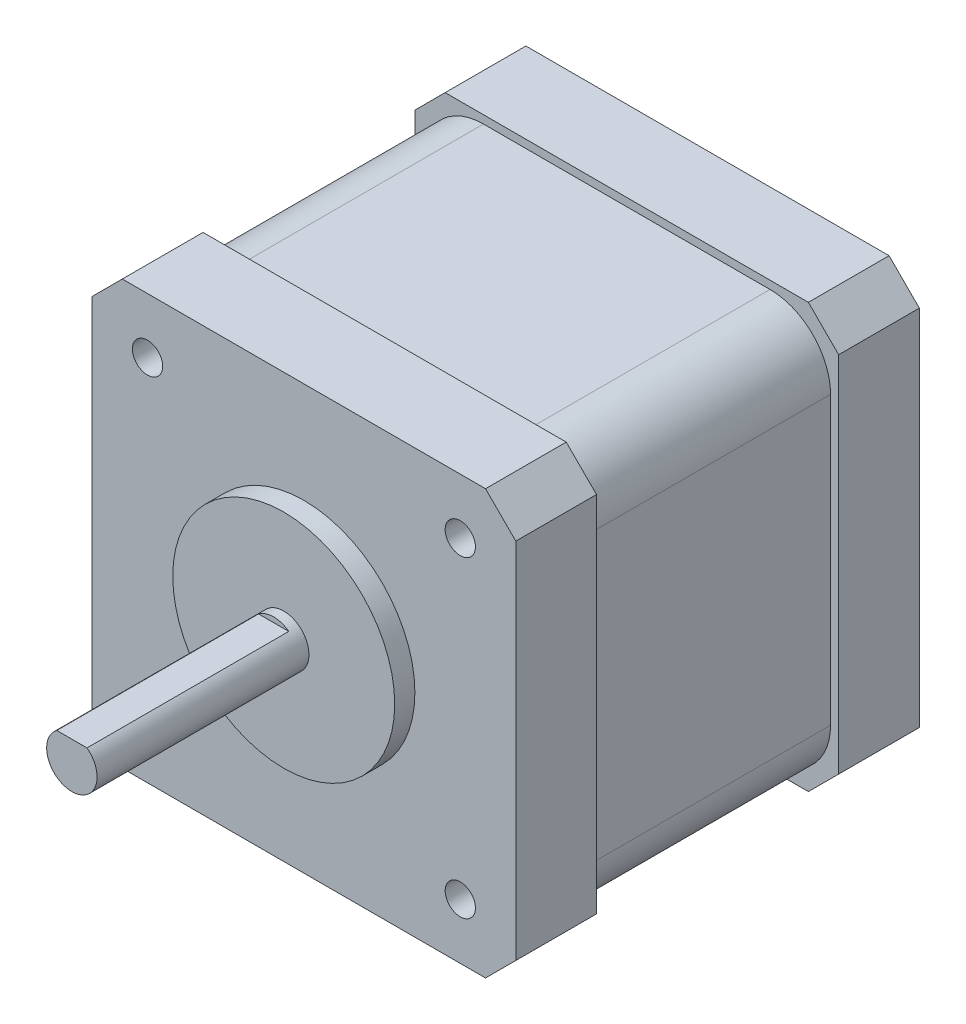
ISO-10303-21;
HEADER;
FILE_DESCRIPTION(('STEP AP214'),'2;1');
FILE_NAME('part.step','',(''),(''),'','','');
FILE_SCHEMA(('AUTOMOTIVE_DESIGN { 1 0 10303 214 1 1 1 1 }'));
ENDSEC;
DATA;
#1=APPLICATION_CONTEXT('core data for automotive mechanical design processes');
#2=APPLICATION_PROTOCOL_DEFINITION('international standard','automotive_design',2000,#1);
#3=PRODUCT_CONTEXT('',#1,'mechanical');
#4=PRODUCT('Part','Part','',(#3));
#5=PRODUCT_RELATED_PRODUCT_CATEGORY('part','',(#4));
#6=PRODUCT_DEFINITION_FORMATION('','',#4);
#7=PRODUCT_DEFINITION_CONTEXT('part definition',#1,'design');
#8=PRODUCT_DEFINITION('design','',#6,#7);
#9=PRODUCT_DEFINITION_SHAPE('','',#8);
#10=(LENGTH_UNIT() NAMED_UNIT(*) SI_UNIT(.MILLI.,.METRE.));
#11=(NAMED_UNIT(*) PLANE_ANGLE_UNIT() SI_UNIT($,.RADIAN.));
#12=(NAMED_UNIT(*) SI_UNIT($,.STERADIAN.) SOLID_ANGLE_UNIT());
#13=UNCERTAINTY_MEASURE_WITH_UNIT(LENGTH_MEASURE(1.E-05),#10,'distance_accuracy_value','');
#14=(GEOMETRIC_REPRESENTATION_CONTEXT(3) GLOBAL_UNCERTAINTY_ASSIGNED_CONTEXT((#13)) GLOBAL_UNIT_ASSIGNED_CONTEXT((#10,
#11,#12)) REPRESENTATION_CONTEXT('',''));
#15=CARTESIAN_POINT('',(0.,0.,0.));
#16=DIRECTION('',(0.,0.,1.));
#17=DIRECTION('',(1.,0.,0.));
#18=AXIS2_PLACEMENT_3D('',#15,#16,#17);
#19=CARTESIAN_POINT('',(-21.,-21.,0.));
#20=DIRECTION('',(0.,0.,1.));
#21=DIRECTION('',(1.,0.,0.));
#22=AXIS2_PLACEMENT_3D('',#19,#20,#21);
#23=PLANE('',#22);
#24=DIRECTION('',(-0.707106781186548,0.707106781186548,0.));
#25=VECTOR('',#24,1.);
#26=CARTESIAN_POINT('',(-19.5,-19.5,0.));
#27=LINE('',#26,#25);
#28=CARTESIAN_POINT('',(-18.0000000045,-21.,0.));
#29=VERTEX_POINT('',#28);
#30=CARTESIAN_POINT('',(-21.,-18.0000000045,0.));
#31=VERTEX_POINT('',#30);
#32=EDGE_CURVE('E155',#29,#31,#27,.T.);
#33=ORIENTED_EDGE('',*,*,#32,.T.);
#34=DIRECTION('',(0.,1.,0.));
#35=VECTOR('',#34,1.);
#36=CARTESIAN_POINT('',(-21.,0.,0.));
#37=LINE('',#36,#35);
#38=CARTESIAN_POINT('',(-21.,18.0000000045,0.));
#39=VERTEX_POINT('',#38);
#40=EDGE_CURVE('E179',#31,#39,#37,.T.);
#41=ORIENTED_EDGE('',*,*,#40,.T.);
#42=DIRECTION('',(0.707106781186548,0.707106781186548,0.));
#43=VECTOR('',#42,1.);
#44=CARTESIAN_POINT('',(-19.5,19.5,0.));
#45=LINE('',#44,#43);
#46=CARTESIAN_POINT('',(-18.0000000045,21.,0.));
#47=VERTEX_POINT('',#46);
#48=EDGE_CURVE('E178',#39,#47,#45,.T.);
#49=ORIENTED_EDGE('',*,*,#48,.T.);
#50=DIRECTION('',(1.,0.,0.));
#51=VECTOR('',#50,1.);
#52=CARTESIAN_POINT('',(0.,21.,0.));
#53=LINE('',#52,#51);
#54=CARTESIAN_POINT('',(18.0000000045,21.,0.));
#55=VERTEX_POINT('',#54);
#56=EDGE_CURVE('E176',#47,#55,#53,.T.);
#57=ORIENTED_EDGE('',*,*,#56,.T.);
#58=DIRECTION('',(0.707106781186548,-0.707106781186548,0.));
#59=VECTOR('',#58,1.);
#60=CARTESIAN_POINT('',(19.5,19.5,0.));
#61=LINE('',#60,#59);
#62=CARTESIAN_POINT('',(21.,18.0000000045,0.));
#63=VERTEX_POINT('',#62);
#64=EDGE_CURVE('E337',#55,#63,#61,.T.);
#65=ORIENTED_EDGE('',*,*,#64,.T.);
#66=DIRECTION('',(0.,-1.,0.));
#67=VECTOR('',#66,1.);
#68=CARTESIAN_POINT('',(21.,0.,0.));
#69=LINE('',#68,#67);
#70=CARTESIAN_POINT('',(21.,-18.0000000045,0.));
#71=VERTEX_POINT('',#70);
#72=EDGE_CURVE('E336',#63,#71,#69,.T.);
#73=ORIENTED_EDGE('',*,*,#72,.T.);
#74=DIRECTION('',(-0.707106781186548,-0.707106781186548,0.));
#75=VECTOR('',#74,1.);
#76=CARTESIAN_POINT('',(19.5,-19.5,0.));
#77=LINE('',#76,#75);
#78=CARTESIAN_POINT('',(18.0000000045,-21.,0.));
#79=VERTEX_POINT('',#78);
#80=EDGE_CURVE('E357',#71,#79,#77,.T.);
#81=ORIENTED_EDGE('',*,*,#80,.T.);
#82=DIRECTION('',(-1.,0.,0.));
#83=VECTOR('',#82,1.);
#84=CARTESIAN_POINT('',(0.,-21.,0.));
#85=LINE('',#84,#83);
#86=EDGE_CURVE('E347',#79,#29,#85,.T.);
#87=ORIENTED_EDGE('',*,*,#86,.T.);
#88=EDGE_LOOP('',(#33,#41,#49,#57,#65,#73,#81,#87));
#89=FACE_BOUND('',#88,.T.);
#90=ADVANCED_FACE('F16',(#89),#23,.F.);
#91=CARTESIAN_POINT('',(-21.,18.,8.));
#92=DIRECTION('',(0.707106781186547,-0.707106781186547,0.));
#93=DIRECTION('',(0.,0.,-1.));
#94=AXIS2_PLACEMENT_3D('',#91,#92,#93);
#95=PLANE('',#94);
#96=DIRECTION('',(0.,0.,-1.));
#97=VECTOR('',#96,1.);
#98=CARTESIAN_POINT('',(-18.,21.,4.));
#99=LINE('',#98,#97);
#100=CARTESIAN_POINT('',(-18.,21.,8.));
#101=VERTEX_POINT('',#100);
#102=EDGE_CURVE('E183',#101,#47,#99,.T.);
#103=ORIENTED_EDGE('',*,*,#102,.T.);
#104=ORIENTED_EDGE('',*,*,#48,.F.);
#105=DIRECTION('',(0.,0.,1.));
#106=VECTOR('',#105,1.);
#107=CARTESIAN_POINT('',(-21.,18.,4.));
#108=LINE('',#107,#106);
#109=CARTESIAN_POINT('',(-21.,18.,8.));
#110=VERTEX_POINT('',#109);
#111=EDGE_CURVE('E195',#39,#110,#108,.T.);
#112=ORIENTED_EDGE('',*,*,#111,.T.);
#113=DIRECTION('',(0.707106781186547,0.707106781186547,0.));
#114=VECTOR('',#113,1.);
#115=CARTESIAN_POINT('',(-21.,18.,8.));
#116=LINE('',#115,#114);
#117=EDGE_CURVE('E20',#110,#101,#116,.T.);
#118=ORIENTED_EDGE('',*,*,#117,.T.);
#119=EDGE_LOOP('',(#103,#104,#112,#118));
#120=FACE_BOUND('',#119,.T.);
#121=ADVANCED_FACE('F191',(#120),#95,.F.);
#122=CARTESIAN_POINT('',(-18.,21.,8.));
#123=DIRECTION('',(0.,-1.,0.));
#124=DIRECTION('',(0.,0.,-1.));
#125=AXIS2_PLACEMENT_3D('',#122,#123,#124);
#126=PLANE('',#125);
#127=DIRECTION('',(0.,0.,-1.));
#128=VECTOR('',#127,1.);
#129=CARTESIAN_POINT('',(18.,21.,4.));
#130=LINE('',#129,#128);
#131=CARTESIAN_POINT('',(18.,21.,8.));
#132=VERTEX_POINT('',#131);
#133=EDGE_CURVE('E189',#132,#55,#130,.T.);
#134=ORIENTED_EDGE('',*,*,#133,.T.);
#135=ORIENTED_EDGE('',*,*,#56,.F.);
#136=ORIENTED_EDGE('',*,*,#102,.F.);
#137=DIRECTION('',(1.,0.,0.));
#138=VECTOR('',#137,1.);
#139=CARTESIAN_POINT('',(0.,21.,8.));
#140=LINE('',#139,#138);
#141=EDGE_CURVE('E326',#101,#132,#140,.T.);
#142=ORIENTED_EDGE('',*,*,#141,.T.);
#143=EDGE_LOOP('',(#134,#135,#136,#142));
#144=FACE_BOUND('',#143,.T.);
#145=ADVANCED_FACE('F187',(#144),#126,.F.);
#146=CARTESIAN_POINT('',(18.,21.,8.));
#147=DIRECTION('',(-0.707106781186547,-0.707106781186547,0.));
#148=DIRECTION('',(0.,0.,-1.));
#149=AXIS2_PLACEMENT_3D('',#146,#147,#148);
#150=PLANE('',#149);
#151=DIRECTION('',(0.,0.,-1.));
#152=VECTOR('',#151,1.);
#153=CARTESIAN_POINT('',(21.,18.,4.));
#154=LINE('',#153,#152);
#155=CARTESIAN_POINT('',(21.,18.,8.));
#156=VERTEX_POINT('',#155);
#157=EDGE_CURVE('E335',#156,#63,#154,.T.);
#158=ORIENTED_EDGE('',*,*,#157,.T.);
#159=ORIENTED_EDGE('',*,*,#64,.F.);
#160=ORIENTED_EDGE('',*,*,#133,.F.);
#161=DIRECTION('',(0.707106781186547,-0.707106781186547,0.));
#162=VECTOR('',#161,1.);
#163=CARTESIAN_POINT('',(18.,21.,8.));
#164=LINE('',#163,#162);
#165=EDGE_CURVE('E324',#132,#156,#164,.T.);
#166=ORIENTED_EDGE('',*,*,#165,.T.);
#167=EDGE_LOOP('',(#158,#159,#160,#166));
#168=FACE_BOUND('',#167,.T.);
#169=ADVANCED_FACE('F532',(#168),#150,.F.);
#170=CARTESIAN_POINT('',(21.,18.,0.));
#171=DIRECTION('',(-1.,0.,0.));
#172=DIRECTION('',(0.,-1.,0.));
#173=AXIS2_PLACEMENT_3D('',#170,#171,#172);
#174=PLANE('',#173);
#175=DIRECTION('',(0.,0.,-1.));
#176=VECTOR('',#175,1.);
#177=CARTESIAN_POINT('',(21.,-18.,4.));
#178=LINE('',#177,#176);
#179=CARTESIAN_POINT('',(21.,-18.,8.));
#180=VERTEX_POINT('',#179);
#181=EDGE_CURVE('E338',#180,#71,#178,.T.);
#182=ORIENTED_EDGE('',*,*,#181,.T.);
#183=ORIENTED_EDGE('',*,*,#72,.F.);
#184=ORIENTED_EDGE('',*,*,#157,.F.);
#185=DIRECTION('',(0.,-1.,0.));
#186=VECTOR('',#185,1.);
#187=CARTESIAN_POINT('',(21.,0.,8.));
#188=LINE('',#187,#186);
#189=EDGE_CURVE('E323',#156,#180,#188,.T.);
#190=ORIENTED_EDGE('',*,*,#189,.T.);
#191=EDGE_LOOP('',(#182,#183,#184,#190));
#192=FACE_BOUND('',#191,.T.);
#193=ADVANCED_FACE('F535',(#192),#174,.F.);
#194=CARTESIAN_POINT('',(21.,-18.,8.));
#195=DIRECTION('',(-0.707106781186547,0.707106781186547,0.));
#196=DIRECTION('',(0.,0.,-1.));
#197=AXIS2_PLACEMENT_3D('',#194,#195,#196);
#198=PLANE('',#197);
#199=DIRECTION('',(0.,0.,-1.));
#200=VECTOR('',#199,1.);
#201=CARTESIAN_POINT('',(18.,-21.,4.));
#202=LINE('',#201,#200);
#203=CARTESIAN_POINT('',(18.,-21.,8.));
#204=VERTEX_POINT('',#203);
#205=EDGE_CURVE('E358',#204,#79,#202,.T.);
#206=ORIENTED_EDGE('',*,*,#205,.T.);
#207=ORIENTED_EDGE('',*,*,#80,.F.);
#208=ORIENTED_EDGE('',*,*,#181,.F.);
#209=DIRECTION('',(-0.707106781186547,-0.707106781186547,0.));
#210=VECTOR('',#209,1.);
#211=CARTESIAN_POINT('',(21.,-18.,8.));
#212=LINE('',#211,#210);
#213=EDGE_CURVE('E321',#180,#204,#212,.T.);
#214=ORIENTED_EDGE('',*,*,#213,.T.);
#215=EDGE_LOOP('',(#206,#207,#208,#214));
#216=FACE_BOUND('',#215,.T.);
#217=ADVANCED_FACE('F538',(#216),#198,.F.);
#218=CARTESIAN_POINT('',(-18.,-21.,0.));
#219=DIRECTION('',(0.,1.,0.));
#220=DIRECTION('',(0.,0.,1.));
#221=AXIS2_PLACEMENT_3D('',#218,#219,#220);
#222=PLANE('',#221);
#223=DIRECTION('',(0.,0.,-1.));
#224=VECTOR('',#223,1.);
#225=CARTESIAN_POINT('',(-18.,-21.,4.));
#226=LINE('',#225,#224);
#227=CARTESIAN_POINT('',(-18.,-21.,8.));
#228=VERTEX_POINT('',#227);
#229=EDGE_CURVE('E344',#228,#29,#226,.T.);
#230=ORIENTED_EDGE('',*,*,#229,.T.);
#231=ORIENTED_EDGE('',*,*,#86,.F.);
#232=ORIENTED_EDGE('',*,*,#205,.F.);
#233=DIRECTION('',(-1.,0.,0.));
#234=VECTOR('',#233,1.);
#235=CARTESIAN_POINT('',(0.,-21.,8.));
#236=LINE('',#235,#234);
#237=EDGE_CURVE('E320',#204,#228,#236,.T.);
#238=ORIENTED_EDGE('',*,*,#237,.T.);
#239=EDGE_LOOP('',(#230,#231,#232,#238));
#240=FACE_BOUND('',#239,.T.);
#241=ADVANCED_FACE('F542',(#240),#222,.F.);
#242=CARTESIAN_POINT('',(-18.,-21.,8.));
#243=DIRECTION('',(0.707106781186547,0.707106781186547,0.));
#244=DIRECTION('',(0.,0.,-1.));
#245=AXIS2_PLACEMENT_3D('',#242,#243,#244);
#246=PLANE('',#245);
#247=DIRECTION('',(0.,0.,-1.));
#248=VECTOR('',#247,1.);
#249=CARTESIAN_POINT('',(-21.,-18.,4.));
#250=LINE('',#249,#248);
#251=CARTESIAN_POINT('',(-21.,-18.,8.));
#252=VERTEX_POINT('',#251);
#253=EDGE_CURVE('E350',#252,#31,#250,.T.);
#254=ORIENTED_EDGE('',*,*,#253,.T.);
#255=ORIENTED_EDGE('',*,*,#32,.F.);
#256=ORIENTED_EDGE('',*,*,#229,.F.);
#257=DIRECTION('',(-0.707106781186547,0.707106781186547,0.));
#258=VECTOR('',#257,1.);
#259=CARTESIAN_POINT('',(-18.,-21.,8.));
#260=LINE('',#259,#258);
#261=EDGE_CURVE('E316',#228,#252,#260,.T.);
#262=ORIENTED_EDGE('',*,*,#261,.T.);
#263=EDGE_LOOP('',(#254,#255,#256,#262));
#264=FACE_BOUND('',#263,.T.);
#265=ADVANCED_FACE('F545',(#264),#246,.F.);
#266=CARTESIAN_POINT('',(-21.,-18.,8.));
#267=DIRECTION('',(1.,0.,0.));
#268=DIRECTION('',(0.,0.,-1.));
#269=AXIS2_PLACEMENT_3D('',#266,#267,#268);
#270=PLANE('',#269);
#271=ORIENTED_EDGE('',*,*,#253,.F.);
#272=DIRECTION('',(0.,1.,0.));
#273=VECTOR('',#272,1.);
#274=CARTESIAN_POINT('',(-21.,0.,8.));
#275=LINE('',#274,#273);
#276=EDGE_CURVE('E319',#252,#110,#275,.T.);
#277=ORIENTED_EDGE('',*,*,#276,.T.);
#278=ORIENTED_EDGE('',*,*,#111,.F.);
#279=ORIENTED_EDGE('',*,*,#40,.F.);
#280=EDGE_LOOP('',(#271,#277,#278,#279));
#281=FACE_BOUND('',#280,.T.);
#282=ADVANCED_FACE('F549',(#281),#270,.F.);
#283=CARTESIAN_POINT('',(-21.,-21.,8.));
#284=DIRECTION('',(0.,0.,-1.));
#285=DIRECTION('',(0.,1.,0.));
#286=AXIS2_PLACEMENT_3D('',#283,#284,#285);
#287=PLANE('',#286);
#288=CARTESIAN_POINT('',(14.2,14.2,8.));
#289=DIRECTION('',(0.,0.,1.));
#290=DIRECTION('',(1.,0.,0.));
#291=AXIS2_PLACEMENT_3D('',#288,#289,#290);
#292=CIRCLE('',#291,6.);
#293=CARTESIAN_POINT('',(14.1999999987694,20.2,8.));
#294=VERTEX_POINT('',#293);
#295=CARTESIAN_POINT('',(20.2,14.2,8.));
#296=VERTEX_POINT('',#295);
#297=EDGE_CURVE('E296',#294,#296,#292,.F.);
#298=ORIENTED_EDGE('',*,*,#297,.T.);
#299=DIRECTION('',(0.,1.,0.));
#300=VECTOR('',#299,1.);
#301=CARTESIAN_POINT('',(20.2,0.,8.));
#302=LINE('',#301,#300);
#303=CARTESIAN_POINT('',(20.2,-14.2,8.));
#304=VERTEX_POINT('',#303);
#305=EDGE_CURVE('E373',#304,#296,#302,.T.);
#306=ORIENTED_EDGE('',*,*,#305,.F.);
#307=CARTESIAN_POINT('',(14.2,-14.2,8.));
#308=DIRECTION('',(0.,0.,-1.));
#309=DIRECTION('',(-1.,0.,0.));
#310=AXIS2_PLACEMENT_3D('',#307,#308,#309);
#311=CIRCLE('',#310,6.);
#312=CARTESIAN_POINT('',(14.2,-20.2,8.));
#313=VERTEX_POINT('',#312);
#314=EDGE_CURVE('E311',#304,#313,#311,.T.);
#315=ORIENTED_EDGE('',*,*,#314,.T.);
#316=DIRECTION('',(1.,0.,0.));
#317=VECTOR('',#316,1.);
#318=CARTESIAN_POINT('',(0.,-20.2,8.));
#319=LINE('',#318,#317);
#320=CARTESIAN_POINT('',(-14.2000000005388,-20.2,8.));
#321=VERTEX_POINT('',#320);
#322=EDGE_CURVE('E314',#321,#313,#319,.T.);
#323=ORIENTED_EDGE('',*,*,#322,.F.);
#324=CARTESIAN_POINT('',(-14.2,-14.2,8.));
#325=DIRECTION('',(0.,0.,1.));
#326=DIRECTION('',(1.,0.,0.));
#327=AXIS2_PLACEMENT_3D('',#324,#325,#326);
#328=CIRCLE('',#327,6.);
#329=CARTESIAN_POINT('',(-20.2,-14.2,8.));
#330=VERTEX_POINT('',#329);
#331=EDGE_CURVE('E306',#321,#330,#328,.F.);
#332=ORIENTED_EDGE('',*,*,#331,.T.);
#333=DIRECTION('',(0.,-1.,0.));
#334=VECTOR('',#333,1.);
#335=CARTESIAN_POINT('',(-20.2,0.,8.));
#336=LINE('',#335,#334);
#337=CARTESIAN_POINT('',(-20.2,14.1999999987694,8.));
#338=VERTEX_POINT('',#337);
#339=EDGE_CURVE('E309',#338,#330,#336,.T.);
#340=ORIENTED_EDGE('',*,*,#339,.F.);
#341=CARTESIAN_POINT('',(-14.2,14.2,8.));
#342=DIRECTION('',(0.,0.,1.));
#343=DIRECTION('',(1.,0.,0.));
#344=AXIS2_PLACEMENT_3D('',#341,#342,#343);
#345=CIRCLE('',#344,6.);
#346=CARTESIAN_POINT('',(-14.2,20.2,8.));
#347=VERTEX_POINT('',#346);
#348=EDGE_CURVE('E301',#338,#347,#345,.F.);
#349=ORIENTED_EDGE('',*,*,#348,.T.);
#350=DIRECTION('',(-1.,0.,0.));
#351=VECTOR('',#350,1.);
#352=CARTESIAN_POINT('',(0.,20.2,8.));
#353=LINE('',#352,#351);
#354=EDGE_CURVE('E304',#294,#347,#353,.T.);
#355=ORIENTED_EDGE('',*,*,#354,.F.);
#356=EDGE_LOOP('',(#298,#306,#315,#323,#332,#340,#349,#355));
#357=FACE_BOUND('',#356,.T.);
#358=ORIENTED_EDGE('',*,*,#261,.F.);
#359=ORIENTED_EDGE('',*,*,#237,.F.);
#360=ORIENTED_EDGE('',*,*,#213,.F.);
#361=ORIENTED_EDGE('',*,*,#189,.F.);
#362=ORIENTED_EDGE('',*,*,#165,.F.);
#363=ORIENTED_EDGE('',*,*,#141,.F.);
#364=ORIENTED_EDGE('',*,*,#117,.F.);
#365=ORIENTED_EDGE('',*,*,#276,.F.);
#366=EDGE_LOOP('',(#358,#359,#360,#361,#362,#363,#364,#365));
#367=FACE_BOUND('',#366,.T.);
#368=ADVANCED_FACE('F553',(#357,#367),#287,.F.);
#369=CARTESIAN_POINT('',(-1.518,2.,43.));
#370=DIRECTION('',(0.,0.,1.));
#371=DIRECTION('',(1.,0.,0.));
#372=AXIS2_PLACEMENT_3D('',#369,#370,#371);
#373=PLANE('',#372);
#374=CARTESIAN_POINT('',(0.,0.,43.000000008));
#375=DIRECTION('',(0.,0.,-1.));
#376=DIRECTION('',(-1.,0.,0.));
#377=AXIS2_PLACEMENT_3D('',#374,#375,#376);
#378=CIRCLE('',#377,2.5);
#379=CARTESIAN_POINT('',(1.50000000041182,1.99999999984557,43.000000004));
#380=VERTEX_POINT('',#379);
#381=CARTESIAN_POINT('',(-1.50000000000161,1.9999999999994,43.000000004));
#382=VERTEX_POINT('',#381);
#383=EDGE_CURVE('E292',#380,#382,#378,.F.);
#384=ORIENTED_EDGE('',*,*,#383,.T.);
#385=DIRECTION('',(1.,0.,0.));
#386=VECTOR('',#385,1.);
#387=CARTESIAN_POINT('',(0.,2.,43.));
#388=LINE('',#387,#386);
#389=EDGE_CURVE('E355',#382,#380,#388,.T.);
#390=ORIENTED_EDGE('',*,*,#389,.T.);
#391=EDGE_LOOP('',(#384,#390));
#392=FACE_BOUND('',#391,.T.);
#393=ADVANCED_FACE('F557',(#392),#373,.T.);
#394=CARTESIAN_POINT('',(-1.5,2.,63.));
#395=DIRECTION('',(0.,-1.,0.));
#396=DIRECTION('',(0.,0.,-1.));
#397=AXIS2_PLACEMENT_3D('',#394,#395,#396);
#398=PLANE('',#397);
#399=DIRECTION('',(0.,0.,1.));
#400=VECTOR('',#399,1.);
#401=CARTESIAN_POINT('',(1.50000000082364,1.99999999938227,52.5));
#402=LINE('',#401,#400);
#403=CARTESIAN_POINT('',(1.50000000041182,1.99999999969114,63.));
#404=VERTEX_POINT('',#403);
#405=EDGE_CURVE('E295',#404,#380,#402,.F.);
#406=ORIENTED_EDGE('',*,*,#405,.T.);
#407=ORIENTED_EDGE('',*,*,#389,.F.);
#408=DIRECTION('',(0.,0.,-1.));
#409=VECTOR('',#408,1.);
#410=CARTESIAN_POINT('',(-1.50000000000322,1.99999999999758,52.5));
#411=LINE('',#410,#409);
#412=CARTESIAN_POINT('',(-1.50000000000161,1.99999999999879,63.));
#413=VERTEX_POINT('',#412);
#414=EDGE_CURVE('E291',#382,#413,#411,.F.);
#415=ORIENTED_EDGE('',*,*,#414,.T.);
#416=DIRECTION('',(-1.,0.,0.));
#417=VECTOR('',#416,1.);
#418=CARTESIAN_POINT('',(0.,2.,63.));
#419=LINE('',#418,#417);
#420=EDGE_CURVE('E315',#404,#413,#419,.T.);
#421=ORIENTED_EDGE('',*,*,#420,.F.);
#422=EDGE_LOOP('',(#406,#407,#415,#421));
#423=FACE_BOUND('',#422,.T.);
#424=ADVANCED_FACE('F561',(#423),#398,.F.);
#425=CARTESIAN_POINT('',(-2.53,-2.527,63.));
#426=DIRECTION('',(0.,0.,1.));
#427=DIRECTION('',(1.,0.,0.));
#428=AXIS2_PLACEMENT_3D('',#425,#426,#427);
#429=PLANE('',#428);
#430=ORIENTED_EDGE('',*,*,#420,.T.);
#431=CARTESIAN_POINT('',(0.,0.,63.));
#432=DIRECTION('',(0.,0.,-1.));
#433=DIRECTION('',(-1.,0.,0.));
#434=AXIS2_PLACEMENT_3D('',#431,#432,#433);
#435=CIRCLE('',#434,2.5);
#436=EDGE_CURVE('E288',#413,#404,#435,.F.);
#437=ORIENTED_EDGE('',*,*,#436,.T.);
#438=EDGE_LOOP('',(#430,#437));
#439=FACE_BOUND('',#438,.T.);
#440=ADVANCED_FACE('F524',(#439),#429,.T.);
#441=CARTESIAN_POINT('',(14.2,-14.2,32.));
#442=DIRECTION('',(0.,0.,-1.));
#443=DIRECTION('',(-1.,0.,0.));
#444=AXIS2_PLACEMENT_3D('',#441,#442,#443);
#445=CYLINDRICAL_SURFACE('',#444,6.);
#446=DIRECTION('',(0.,0.,1.));
#447=VECTOR('',#446,1.);
#448=CARTESIAN_POINT('',(14.2,-20.2,20.));
#449=LINE('',#448,#447);
#450=CARTESIAN_POINT('',(14.2,-20.200000001,32.));
#451=VERTEX_POINT('',#450);
#452=EDGE_CURVE('E368',#313,#451,#449,.T.);
#453=ORIENTED_EDGE('',*,*,#452,.F.);
#454=ORIENTED_EDGE('',*,*,#314,.F.);
#455=DIRECTION('',(0.,0.,-1.));
#456=VECTOR('',#455,1.);
#457=CARTESIAN_POINT('',(20.2,-14.2,20.));
#458=LINE('',#457,#456);
#459=CARTESIAN_POINT('',(20.200000001,-14.2,32.));
#460=VERTEX_POINT('',#459);
#461=EDGE_CURVE('E299',#460,#304,#458,.T.);
#462=ORIENTED_EDGE('',*,*,#461,.F.);
#463=CARTESIAN_POINT('',(14.2,-14.2,32.));
#464=DIRECTION('',(0.,0.,-1.));
#465=DIRECTION('',(-1.,0.,0.));
#466=AXIS2_PLACEMENT_3D('',#463,#464,#465);
#467=CIRCLE('',#466,6.);
#468=EDGE_CURVE('E285',#460,#451,#467,.T.);
#469=ORIENTED_EDGE('',*,*,#468,.T.);
#470=EDGE_LOOP('',(#453,#454,#462,#469));
#471=FACE_BOUND('',#470,.T.);
#472=ADVANCED_FACE('F521',(#471),#445,.T.);
#473=CARTESIAN_POINT('',(-14.2,-20.2,8.));
#474=DIRECTION('',(0.,-1.,0.));
#475=DIRECTION('',(1.,0.,0.));
#476=AXIS2_PLACEMENT_3D('',#473,#474,#475);
#477=PLANE('',#476);
#478=ORIENTED_EDGE('',*,*,#322,.T.);
#479=ORIENTED_EDGE('',*,*,#452,.T.);
#480=DIRECTION('',(-1.,0.,0.));
#481=VECTOR('',#480,1.);
#482=CARTESIAN_POINT('',(0.,-20.200000002,32.));
#483=LINE('',#482,#481);
#484=CARTESIAN_POINT('',(-14.2000000005388,-20.200000001,32.));
#485=VERTEX_POINT('',#484);
#486=EDGE_CURVE('E284',#451,#485,#483,.T.);
#487=ORIENTED_EDGE('',*,*,#486,.T.);
#488=DIRECTION('',(0.,0.,1.));
#489=VECTOR('',#488,1.);
#490=CARTESIAN_POINT('',(-14.2000000010775,-20.2,20.));
#491=LINE('',#490,#489);
#492=EDGE_CURVE('E310',#485,#321,#491,.F.);
#493=ORIENTED_EDGE('',*,*,#492,.T.);
#494=EDGE_LOOP('',(#478,#479,#487,#493));
#495=FACE_BOUND('',#494,.T.);
#496=ADVANCED_FACE('F519',(#495),#477,.T.);
#497=CARTESIAN_POINT('',(-14.2,-14.2,8.));
#498=DIRECTION('',(0.,0.,1.));
#499=DIRECTION('',(1.,0.,0.));
#500=AXIS2_PLACEMENT_3D('',#497,#498,#499);
#501=CYLINDRICAL_SURFACE('',#500,6.);
#502=ORIENTED_EDGE('',*,*,#492,.F.);
#503=CARTESIAN_POINT('',(-14.2,-14.2,32.));
#504=DIRECTION('',(0.,0.,1.));
#505=DIRECTION('',(1.,0.,0.));
#506=AXIS2_PLACEMENT_3D('',#503,#504,#505);
#507=CIRCLE('',#506,6.);
#508=CARTESIAN_POINT('',(-20.200000001,-14.2,32.));
#509=VERTEX_POINT('',#508);
#510=EDGE_CURVE('E281',#485,#509,#507,.F.);
#511=ORIENTED_EDGE('',*,*,#510,.T.);
#512=DIRECTION('',(0.,0.,1.));
#513=VECTOR('',#512,1.);
#514=CARTESIAN_POINT('',(-20.2,-14.2,20.));
#515=LINE('',#514,#513);
#516=EDGE_CURVE('E370',#330,#509,#515,.T.);
#517=ORIENTED_EDGE('',*,*,#516,.F.);
#518=ORIENTED_EDGE('',*,*,#331,.F.);
#519=EDGE_LOOP('',(#502,#511,#517,#518));
#520=FACE_BOUND('',#519,.T.);
#521=ADVANCED_FACE('F516',(#520),#501,.T.);
#522=CARTESIAN_POINT('',(-20.2,14.2,8.));
#523=DIRECTION('',(-1.,0.,0.));
#524=DIRECTION('',(0.,-1.,0.));
#525=AXIS2_PLACEMENT_3D('',#522,#523,#524);
#526=PLANE('',#525);
#527=ORIENTED_EDGE('',*,*,#339,.T.);
#528=ORIENTED_EDGE('',*,*,#516,.T.);
#529=DIRECTION('',(0.,1.,0.));
#530=VECTOR('',#529,1.);
#531=CARTESIAN_POINT('',(-20.200000002,0.,32.));
#532=LINE('',#531,#530);
#533=CARTESIAN_POINT('',(-20.200000001,14.1999999987694,32.));
#534=VERTEX_POINT('',#533);
#535=EDGE_CURVE('E280',#509,#534,#532,.T.);
#536=ORIENTED_EDGE('',*,*,#535,.T.);
#537=DIRECTION('',(0.,0.,1.));
#538=VECTOR('',#537,1.);
#539=CARTESIAN_POINT('',(-20.2,14.1999999975388,20.));
#540=LINE('',#539,#538);
#541=EDGE_CURVE('E305',#534,#338,#540,.F.);
#542=ORIENTED_EDGE('',*,*,#541,.T.);
#543=EDGE_LOOP('',(#527,#528,#536,#542));
#544=FACE_BOUND('',#543,.T.);
#545=ADVANCED_FACE('F514',(#544),#526,.T.);
#546=CARTESIAN_POINT('',(-14.2,14.2,8.));
#547=DIRECTION('',(0.,0.,1.));
#548=DIRECTION('',(1.,0.,0.));
#549=AXIS2_PLACEMENT_3D('',#546,#547,#548);
#550=CYLINDRICAL_SURFACE('',#549,6.);
#551=ORIENTED_EDGE('',*,*,#541,.F.);
#552=CARTESIAN_POINT('',(-14.2,14.2,32.));
#553=DIRECTION('',(0.,0.,1.));
#554=DIRECTION('',(1.,0.,0.));
#555=AXIS2_PLACEMENT_3D('',#552,#553,#554);
#556=CIRCLE('',#555,6.);
#557=CARTESIAN_POINT('',(-14.2,20.200000001,32.));
#558=VERTEX_POINT('',#557);
#559=EDGE_CURVE('E277',#534,#558,#556,.F.);
#560=ORIENTED_EDGE('',*,*,#559,.T.);
#561=DIRECTION('',(0.,0.,1.));
#562=VECTOR('',#561,1.);
#563=CARTESIAN_POINT('',(-14.2,20.2,20.));
#564=LINE('',#563,#562);
#565=EDGE_CURVE('E372',#347,#558,#564,.T.);
#566=ORIENTED_EDGE('',*,*,#565,.F.);
#567=ORIENTED_EDGE('',*,*,#348,.F.);
#568=EDGE_LOOP('',(#551,#560,#566,#567));
#569=FACE_BOUND('',#568,.T.);
#570=ADVANCED_FACE('F511',(#569),#550,.T.);
#571=CARTESIAN_POINT('',(14.2,20.2,8.));
#572=DIRECTION('',(0.,1.,0.));
#573=DIRECTION('',(-1.,0.,0.));
#574=AXIS2_PLACEMENT_3D('',#571,#572,#573);
#575=PLANE('',#574);
#576=DIRECTION('',(1.,0.,0.));
#577=VECTOR('',#576,1.);
#578=CARTESIAN_POINT('',(0.,20.200000002,32.));
#579=LINE('',#578,#577);
#580=CARTESIAN_POINT('',(14.1999999987694,20.200000001,32.));
#581=VERTEX_POINT('',#580);
#582=EDGE_CURVE('E276',#558,#581,#579,.T.);
#583=ORIENTED_EDGE('',*,*,#582,.T.);
#584=DIRECTION('',(0.,0.,1.));
#585=VECTOR('',#584,1.);
#586=CARTESIAN_POINT('',(14.1999999975388,20.2,20.));
#587=LINE('',#586,#585);
#588=EDGE_CURVE('E300',#581,#294,#587,.F.);
#589=ORIENTED_EDGE('',*,*,#588,.T.);
#590=ORIENTED_EDGE('',*,*,#354,.T.);
#591=ORIENTED_EDGE('',*,*,#565,.T.);
#592=EDGE_LOOP('',(#583,#589,#590,#591));
#593=FACE_BOUND('',#592,.T.);
#594=ADVANCED_FACE('F509',(#593),#575,.T.);
#595=CARTESIAN_POINT('',(14.2,14.2,8.));
#596=DIRECTION('',(0.,0.,1.));
#597=DIRECTION('',(1.,0.,0.));
#598=AXIS2_PLACEMENT_3D('',#595,#596,#597);
#599=CYLINDRICAL_SURFACE('',#598,6.);
#600=ORIENTED_EDGE('',*,*,#588,.F.);
#601=CARTESIAN_POINT('',(14.2,14.2,32.));
#602=DIRECTION('',(0.,0.,1.));
#603=DIRECTION('',(1.,0.,0.));
#604=AXIS2_PLACEMENT_3D('',#601,#602,#603);
#605=CIRCLE('',#604,6.);
#606=CARTESIAN_POINT('',(20.200000001,14.2,32.));
#607=VERTEX_POINT('',#606);
#608=EDGE_CURVE('E273',#581,#607,#605,.F.);
#609=ORIENTED_EDGE('',*,*,#608,.T.);
#610=DIRECTION('',(0.,0.,1.));
#611=VECTOR('',#610,1.);
#612=CARTESIAN_POINT('',(20.2,14.2,20.));
#613=LINE('',#612,#611);
#614=EDGE_CURVE('E375',#296,#607,#613,.T.);
#615=ORIENTED_EDGE('',*,*,#614,.F.);
#616=ORIENTED_EDGE('',*,*,#297,.F.);
#617=EDGE_LOOP('',(#600,#609,#615,#616));
#618=FACE_BOUND('',#617,.T.);
#619=ADVANCED_FACE('F506',(#618),#599,.T.);
#620=CARTESIAN_POINT('',(20.2,-14.2,8.));
#621=DIRECTION('',(1.,0.,0.));
#622=DIRECTION('',(0.,1.,0.));
#623=AXIS2_PLACEMENT_3D('',#620,#621,#622);
#624=PLANE('',#623);
#625=ORIENTED_EDGE('',*,*,#305,.T.);
#626=ORIENTED_EDGE('',*,*,#614,.T.);
#627=DIRECTION('',(0.,-1.,0.));
#628=VECTOR('',#627,1.);
#629=CARTESIAN_POINT('',(20.200000002,0.,32.));
#630=LINE('',#629,#628);
#631=EDGE_CURVE('E272',#607,#460,#630,.T.);
#632=ORIENTED_EDGE('',*,*,#631,.T.);
#633=ORIENTED_EDGE('',*,*,#461,.T.);
#634=EDGE_LOOP('',(#625,#626,#632,#633));
#635=FACE_BOUND('',#634,.T.);
#636=ADVANCED_FACE('F504',(#635),#624,.T.);
#637=CARTESIAN_POINT('',(0.,0.,63.));
#638=DIRECTION('',(0.,0.,-1.));
#639=DIRECTION('',(-1.,0.,0.));
#640=AXIS2_PLACEMENT_3D('',#637,#638,#639);
#641=CYLINDRICAL_SURFACE('',#640,2.5);
#642=CARTESIAN_POINT('',(0.,0.,42.));
#643=DIRECTION('',(0.,0.,-1.));
#644=DIRECTION('',(-1.,0.,0.));
#645=AXIS2_PLACEMENT_3D('',#642,#643,#644);
#646=CIRCLE('',#645,2.5);
#647=CARTESIAN_POINT('',(-2.5,0.,42.));
#648=VERTEX_POINT('',#647);
#649=EDGE_CURVE('E268',#648,#648,#646,.T.);
#650=ORIENTED_EDGE('',*,*,#649,.F.);
#651=EDGE_LOOP('',(#650));
#652=FACE_BOUND('',#651,.T.);
#653=ORIENTED_EDGE('',*,*,#436,.F.);
#654=ORIENTED_EDGE('',*,*,#414,.F.);
#655=ORIENTED_EDGE('',*,*,#383,.F.);
#656=ORIENTED_EDGE('',*,*,#405,.F.);
#657=EDGE_LOOP('',(#653,#654,#655,#656));
#658=FACE_BOUND('',#657,.T.);
#659=ADVANCED_FACE('F501',(#652,#658),#641,.T.);
#660=CARTESIAN_POINT('',(-21.,-21.,32.));
#661=DIRECTION('',(0.,0.,1.));
#662=DIRECTION('',(1.,0.,0.));
#663=AXIS2_PLACEMENT_3D('',#660,#661,#662);
#664=PLANE('',#663);
#665=ORIENTED_EDGE('',*,*,#608,.F.);
#666=ORIENTED_EDGE('',*,*,#582,.F.);
#667=ORIENTED_EDGE('',*,*,#559,.F.);
#668=ORIENTED_EDGE('',*,*,#535,.F.);
#669=ORIENTED_EDGE('',*,*,#510,.F.);
#670=ORIENTED_EDGE('',*,*,#486,.F.);
#671=ORIENTED_EDGE('',*,*,#468,.F.);
#672=ORIENTED_EDGE('',*,*,#631,.F.);
#673=EDGE_LOOP('',(#665,#666,#667,#668,#669,#670,#671,#672));
#674=FACE_BOUND('',#673,.T.);
#675=DIRECTION('',(0.707106781186548,0.707106781186548,0.));
#676=VECTOR('',#675,1.);
#677=CARTESIAN_POINT('',(-19.5,19.5,32.));
#678=LINE('',#677,#676);
#679=CARTESIAN_POINT('',(-21.,18.000000009,32.));
#680=VERTEX_POINT('',#679);
#681=CARTESIAN_POINT('',(-18.000000009,21.,32.));
#682=VERTEX_POINT('',#681);
#683=EDGE_CURVE('E216',#680,#682,#678,.T.);
#684=ORIENTED_EDGE('',*,*,#683,.T.);
#685=DIRECTION('',(1.,0.,0.));
#686=VECTOR('',#685,1.);
#687=CARTESIAN_POINT('',(0.,21.,32.));
#688=LINE('',#687,#686);
#689=CARTESIAN_POINT('',(18.0000000045,21.,32.));
#690=VERTEX_POINT('',#689);
#691=EDGE_CURVE('E271',#682,#690,#688,.T.);
#692=ORIENTED_EDGE('',*,*,#691,.T.);
#693=DIRECTION('',(0.707106781186548,-0.707106781186548,0.));
#694=VECTOR('',#693,1.);
#695=CARTESIAN_POINT('',(19.5,19.5,32.));
#696=LINE('',#695,#694);
#697=CARTESIAN_POINT('',(21.,18.000000009,32.));
#698=VERTEX_POINT('',#697);
#699=EDGE_CURVE('E203',#690,#698,#696,.T.);
#700=ORIENTED_EDGE('',*,*,#699,.T.);
#701=DIRECTION('',(0.,-1.,0.));
#702=VECTOR('',#701,1.);
#703=CARTESIAN_POINT('',(21.,0.,32.));
#704=LINE('',#703,#702);
#705=CARTESIAN_POINT('',(21.,-18.0000000045,32.));
#706=VERTEX_POINT('',#705);
#707=EDGE_CURVE('E207',#698,#706,#704,.T.);
#708=ORIENTED_EDGE('',*,*,#707,.T.);
#709=DIRECTION('',(-0.707106781186548,-0.707106781186548,0.));
#710=VECTOR('',#709,1.);
#711=CARTESIAN_POINT('',(19.5,-19.5,32.));
#712=LINE('',#711,#710);
#713=CARTESIAN_POINT('',(18.000000009,-21.,32.));
#714=VERTEX_POINT('',#713);
#715=EDGE_CURVE('E237',#706,#714,#712,.T.);
#716=ORIENTED_EDGE('',*,*,#715,.T.);
#717=DIRECTION('',(-1.,0.,0.));
#718=VECTOR('',#717,1.);
#719=CARTESIAN_POINT('',(0.,-21.,32.));
#720=LINE('',#719,#718);
#721=CARTESIAN_POINT('',(-18.0000000045,-21.,32.));
#722=VERTEX_POINT('',#721);
#723=EDGE_CURVE('E230',#714,#722,#720,.T.);
#724=ORIENTED_EDGE('',*,*,#723,.T.);
#725=DIRECTION('',(-0.707106781186548,0.707106781186548,0.));
#726=VECTOR('',#725,1.);
#727=CARTESIAN_POINT('',(-19.5,-19.5,32.));
#728=LINE('',#727,#726);
#729=CARTESIAN_POINT('',(-21.,-18.000000009,32.));
#730=VERTEX_POINT('',#729);
#731=EDGE_CURVE('E220',#722,#730,#728,.T.);
#732=ORIENTED_EDGE('',*,*,#731,.T.);
#733=DIRECTION('',(0.,1.,0.));
#734=VECTOR('',#733,1.);
#735=CARTESIAN_POINT('',(-21.,0.,32.));
#736=LINE('',#735,#734);
#737=EDGE_CURVE('E215',#730,#680,#736,.T.);
#738=ORIENTED_EDGE('',*,*,#737,.T.);
#739=EDGE_LOOP('',(#684,#692,#700,#708,#716,#724,#732,#738));
#740=FACE_BOUND('',#739,.T.);
#741=ADVANCED_FACE('F420',(#674,#740),#664,.F.);
#742=CARTESIAN_POINT('',(13.982,-17.018,30.));
#743=DIRECTION('',(0.,0.,1.));
#744=DIRECTION('',(1.,0.,0.));
#745=AXIS2_PLACEMENT_3D('',#742,#743,#744);
#746=PLANE('',#745);
#747=CARTESIAN_POINT('',(15.5,-15.5,30.));
#748=DIRECTION('',(0.,0.,1.));
#749=DIRECTION('',(0.,-1.,0.));
#750=AXIS2_PLACEMENT_3D('',#747,#748,#749);
#751=CIRCLE('',#750,1.5);
#752=CARTESIAN_POINT('',(15.5,-17.,30.));
#753=VERTEX_POINT('',#752);
#754=EDGE_CURVE('E202',#753,#753,#751,.F.);
#755=ORIENTED_EDGE('',*,*,#754,.F.);
#756=EDGE_LOOP('',(#755));
#757=FACE_BOUND('',#756,.T.);
#758=ADVANCED_FACE('F583',(#757),#746,.T.);
#759=CARTESIAN_POINT('',(13.982,13.982,30.));
#760=DIRECTION('',(0.,0.,1.));
#761=DIRECTION('',(1.,0.,0.));
#762=AXIS2_PLACEMENT_3D('',#759,#760,#761);
#763=PLANE('',#762);
#764=CARTESIAN_POINT('',(15.5,15.5,30.));
#765=DIRECTION('',(0.,0.,1.));
#766=DIRECTION('',(0.,-1.,0.));
#767=AXIS2_PLACEMENT_3D('',#764,#765,#766);
#768=CIRCLE('',#767,1.5);
#769=CARTESIAN_POINT('',(15.5,14.,30.));
#770=VERTEX_POINT('',#769);
#771=EDGE_CURVE('E263',#770,#770,#768,.F.);
#772=ORIENTED_EDGE('',*,*,#771,.F.);
#773=EDGE_LOOP('',(#772));
#774=FACE_BOUND('',#773,.T.);
#775=ADVANCED_FACE('F587',(#774),#763,.T.);
#776=CARTESIAN_POINT('',(-17.018,13.982,30.));
#777=DIRECTION('',(0.,0.,1.));
#778=DIRECTION('',(1.,0.,0.));
#779=AXIS2_PLACEMENT_3D('',#776,#777,#778);
#780=PLANE('',#779);
#781=CARTESIAN_POINT('',(-15.5,15.5,30.));
#782=DIRECTION('',(0.,0.,1.));
#783=DIRECTION('',(0.,-1.,0.));
#784=AXIS2_PLACEMENT_3D('',#781,#782,#783);
#785=CIRCLE('',#784,1.5);
#786=CARTESIAN_POINT('',(-15.5,14.,30.));
#787=VERTEX_POINT('',#786);
#788=EDGE_CURVE('E260',#787,#787,#785,.F.);
#789=ORIENTED_EDGE('',*,*,#788,.F.);
#790=EDGE_LOOP('',(#789));
#791=FACE_BOUND('',#790,.T.);
#792=ADVANCED_FACE('F591',(#791),#780,.T.);
#793=CARTESIAN_POINT('',(-11.132,-11.132,42.));
#794=DIRECTION('',(0.,0.,1.));
#795=DIRECTION('',(1.,0.,0.));
#796=AXIS2_PLACEMENT_3D('',#793,#794,#795);
#797=PLANE('',#796);
#798=ORIENTED_EDGE('',*,*,#649,.T.);
#799=EDGE_LOOP('',(#798));
#800=FACE_BOUND('',#799,.T.);
#801=CARTESIAN_POINT('',(0.,0.,42.));
#802=DIRECTION('',(0.,0.,-1.));
#803=DIRECTION('',(-1.,0.,0.));
#804=AXIS2_PLACEMENT_3D('',#801,#802,#803);
#805=CIRCLE('',#804,11.);
#806=CARTESIAN_POINT('',(-11.,0.,42.));
#807=VERTEX_POINT('',#806);
#808=EDGE_CURVE('E211',#807,#807,#805,.F.);
#809=ORIENTED_EDGE('',*,*,#808,.T.);
#810=EDGE_LOOP('',(#809));
#811=FACE_BOUND('',#810,.T.);
#812=ADVANCED_FACE('F595',(#800,#811),#797,.T.);
#813=CARTESIAN_POINT('',(-18.,21.,40.));
#814=DIRECTION('',(0.,-1.,0.));
#815=DIRECTION('',(0.,0.,-1.));
#816=AXIS2_PLACEMENT_3D('',#813,#814,#815);
#817=PLANE('',#816);
#818=DIRECTION('',(0.,0.,1.));
#819=VECTOR('',#818,1.);
#820=CARTESIAN_POINT('',(-18.,21.,36.));
#821=LINE('',#820,#819);
#822=CARTESIAN_POINT('',(-18.000000009,21.,40.));
#823=VERTEX_POINT('',#822);
#824=EDGE_CURVE('E212',#682,#823,#821,.T.);
#825=ORIENTED_EDGE('',*,*,#824,.T.);
#826=DIRECTION('',(-1.,0.,0.));
#827=VECTOR('',#826,1.);
#828=CARTESIAN_POINT('',(0.,21.,40.));
#829=LINE('',#828,#827);
#830=CARTESIAN_POINT('',(18.000000009,21.,40.));
#831=VERTEX_POINT('',#830);
#832=EDGE_CURVE('E208',#831,#823,#829,.T.);
#833=ORIENTED_EDGE('',*,*,#832,.F.);
#834=DIRECTION('',(0.,0.,-1.));
#835=VECTOR('',#834,1.);
#836=CARTESIAN_POINT('',(18.,21.,36.));
#837=LINE('',#836,#835);
#838=EDGE_CURVE('E204',#831,#690,#837,.T.);
#839=ORIENTED_EDGE('',*,*,#838,.T.);
#840=ORIENTED_EDGE('',*,*,#691,.F.);
#841=EDGE_LOOP('',(#825,#833,#839,#840));
#842=FACE_BOUND('',#841,.T.);
#843=ADVANCED_FACE('F433',(#842),#817,.F.);
#844=CARTESIAN_POINT('',(-21.,18.,40.));
#845=DIRECTION('',(0.707106781186547,-0.707106781186547,0.));
#846=DIRECTION('',(0.,0.,-1.));
#847=AXIS2_PLACEMENT_3D('',#844,#845,#846);
#848=PLANE('',#847);
#849=ORIENTED_EDGE('',*,*,#824,.F.);
#850=ORIENTED_EDGE('',*,*,#683,.F.);
#851=DIRECTION('',(0.,0.,1.));
#852=VECTOR('',#851,1.);
#853=CARTESIAN_POINT('',(-21.,18.,36.));
#854=LINE('',#853,#852);
#855=CARTESIAN_POINT('',(-21.,18.000000009,40.));
#856=VERTEX_POINT('',#855);
#857=EDGE_CURVE('E217',#680,#856,#854,.T.);
#858=ORIENTED_EDGE('',*,*,#857,.T.);
#859=DIRECTION('',(-0.707106781186547,-0.707106781186547,0.));
#860=VECTOR('',#859,1.);
#861=CARTESIAN_POINT('',(-18.000000018,21.,40.));
#862=LINE('',#861,#860);
#863=EDGE_CURVE('E210',#823,#856,#862,.T.);
#864=ORIENTED_EDGE('',*,*,#863,.F.);
#865=EDGE_LOOP('',(#849,#850,#858,#864));
#866=FACE_BOUND('',#865,.T.);
#867=ADVANCED_FACE('F440',(#866),#848,.F.);
#868=CARTESIAN_POINT('',(-21.,-18.,40.));
#869=DIRECTION('',(1.,0.,0.));
#870=DIRECTION('',(0.,0.,-1.));
#871=AXIS2_PLACEMENT_3D('',#868,#869,#870);
#872=PLANE('',#871);
#873=ORIENTED_EDGE('',*,*,#857,.F.);
#874=ORIENTED_EDGE('',*,*,#737,.F.);
#875=DIRECTION('',(0.,0.,1.));
#876=VECTOR('',#875,1.);
#877=CARTESIAN_POINT('',(-21.,-18.,36.));
#878=LINE('',#877,#876);
#879=CARTESIAN_POINT('',(-21.,-18.000000009,40.));
#880=VERTEX_POINT('',#879);
#881=EDGE_CURVE('E224',#730,#880,#878,.T.);
#882=ORIENTED_EDGE('',*,*,#881,.T.);
#883=DIRECTION('',(0.,-1.,0.));
#884=VECTOR('',#883,1.);
#885=CARTESIAN_POINT('',(-21.,0.,40.));
#886=LINE('',#885,#884);
#887=EDGE_CURVE('E221',#856,#880,#886,.T.);
#888=ORIENTED_EDGE('',*,*,#887,.F.);
#889=EDGE_LOOP('',(#873,#874,#882,#888));
#890=FACE_BOUND('',#889,.T.);
#891=ADVANCED_FACE('F444',(#890),#872,.F.);
#892=CARTESIAN_POINT('',(-18.,-21.,40.));
#893=DIRECTION('',(0.707106781186547,0.707106781186547,0.));
#894=DIRECTION('',(0.,0.,-1.));
#895=AXIS2_PLACEMENT_3D('',#892,#893,#894);
#896=PLANE('',#895);
#897=ORIENTED_EDGE('',*,*,#881,.F.);
#898=ORIENTED_EDGE('',*,*,#731,.F.);
#899=DIRECTION('',(0.,0.,1.));
#900=VECTOR('',#899,1.);
#901=CARTESIAN_POINT('',(-18.,-21.,36.));
#902=LINE('',#901,#900);
#903=CARTESIAN_POINT('',(-18.000000009,-21.,40.));
#904=VERTEX_POINT('',#903);
#905=EDGE_CURVE('E227',#722,#904,#902,.T.);
#906=ORIENTED_EDGE('',*,*,#905,.T.);
#907=DIRECTION('',(0.707106781186547,-0.707106781186547,0.));
#908=VECTOR('',#907,1.);
#909=CARTESIAN_POINT('',(-21.,-18.000000018,40.));
#910=LINE('',#909,#908);
#911=EDGE_CURVE('E223',#880,#904,#910,.T.);
#912=ORIENTED_EDGE('',*,*,#911,.F.);
#913=EDGE_LOOP('',(#897,#898,#906,#912));
#914=FACE_BOUND('',#913,.T.);
#915=ADVANCED_FACE('F450',(#914),#896,.F.);
#916=CARTESIAN_POINT('',(-18.,-21.,32.));
#917=DIRECTION('',(0.,1.,0.));
#918=DIRECTION('',(0.,0.,1.));
#919=AXIS2_PLACEMENT_3D('',#916,#917,#918);
#920=PLANE('',#919);
#921=DIRECTION('',(0.,0.,1.));
#922=VECTOR('',#921,1.);
#923=CARTESIAN_POINT('',(18.,-21.,36.));
#924=LINE('',#923,#922);
#925=CARTESIAN_POINT('',(18.000000009,-21.,40.));
#926=VERTEX_POINT('',#925);
#927=EDGE_CURVE('E233',#714,#926,#924,.T.);
#928=ORIENTED_EDGE('',*,*,#927,.T.);
#929=DIRECTION('',(1.,0.,0.));
#930=VECTOR('',#929,1.);
#931=CARTESIAN_POINT('',(0.,-21.,40.));
#932=LINE('',#931,#930);
#933=EDGE_CURVE('E231',#904,#926,#932,.T.);
#934=ORIENTED_EDGE('',*,*,#933,.F.);
#935=ORIENTED_EDGE('',*,*,#905,.F.);
#936=ORIENTED_EDGE('',*,*,#723,.F.);
#937=EDGE_LOOP('',(#928,#934,#935,#936));
#938=FACE_BOUND('',#937,.T.);
#939=ADVANCED_FACE('F457',(#938),#920,.F.);
#940=CARTESIAN_POINT('',(21.,-18.,40.));
#941=DIRECTION('',(-0.707106781186547,0.707106781186547,0.));
#942=DIRECTION('',(0.,0.,-1.));
#943=AXIS2_PLACEMENT_3D('',#940,#941,#942);
#944=PLANE('',#943);
#945=ORIENTED_EDGE('',*,*,#927,.F.);
#946=ORIENTED_EDGE('',*,*,#715,.F.);
#947=DIRECTION('',(0.,0.,1.));
#948=VECTOR('',#947,1.);
#949=CARTESIAN_POINT('',(21.,-18.,36.));
#950=LINE('',#949,#948);
#951=CARTESIAN_POINT('',(21.,-18.000000009,40.));
#952=VERTEX_POINT('',#951);
#953=EDGE_CURVE('E236',#706,#952,#950,.T.);
#954=ORIENTED_EDGE('',*,*,#953,.T.);
#955=DIRECTION('',(0.707106781186547,0.707106781186547,0.));
#956=VECTOR('',#955,1.);
#957=CARTESIAN_POINT('',(18.000000018,-21.,40.));
#958=LINE('',#957,#956);
#959=EDGE_CURVE('E199',#926,#952,#958,.T.);
#960=ORIENTED_EDGE('',*,*,#959,.F.);
#961=EDGE_LOOP('',(#945,#946,#954,#960));
#962=FACE_BOUND('',#961,.T.);
#963=ADVANCED_FACE('F461',(#962),#944,.F.);
#964=CARTESIAN_POINT('',(21.,18.,32.));
#965=DIRECTION('',(-1.,0.,0.));
#966=DIRECTION('',(0.,-1.,0.));
#967=AXIS2_PLACEMENT_3D('',#964,#965,#966);
#968=PLANE('',#967);
#969=DIRECTION('',(0.,0.,1.));
#970=VECTOR('',#969,1.);
#971=CARTESIAN_POINT('',(21.,18.,36.));
#972=LINE('',#971,#970);
#973=CARTESIAN_POINT('',(21.,18.000000009,40.));
#974=VERTEX_POINT('',#973);
#975=EDGE_CURVE('E200',#698,#974,#972,.T.);
#976=ORIENTED_EDGE('',*,*,#975,.T.);
#977=DIRECTION('',(0.,1.,0.));
#978=VECTOR('',#977,1.);
#979=CARTESIAN_POINT('',(21.,0.,40.));
#980=LINE('',#979,#978);
#981=EDGE_CURVE('E35',#952,#974,#980,.T.);
#982=ORIENTED_EDGE('',*,*,#981,.F.);
#983=ORIENTED_EDGE('',*,*,#953,.F.);
#984=ORIENTED_EDGE('',*,*,#707,.F.);
#985=EDGE_LOOP('',(#976,#982,#983,#984));
#986=FACE_BOUND('',#985,.T.);
#987=ADVANCED_FACE('F464',(#986),#968,.F.);
#988=CARTESIAN_POINT('',(18.,21.,40.));
#989=DIRECTION('',(-0.707106781186547,-0.707106781186547,0.));
#990=DIRECTION('',(0.,0.,-1.));
#991=AXIS2_PLACEMENT_3D('',#988,#989,#990);
#992=PLANE('',#991);
#993=ORIENTED_EDGE('',*,*,#975,.F.);
#994=ORIENTED_EDGE('',*,*,#699,.F.);
#995=ORIENTED_EDGE('',*,*,#838,.F.);
#996=DIRECTION('',(-0.707106781186547,0.707106781186547,0.));
#997=VECTOR('',#996,1.);
#998=CARTESIAN_POINT('',(21.,18.000000018,40.));
#999=LINE('',#998,#997);
#1000=EDGE_CURVE('E198',#974,#831,#999,.T.);
#1001=ORIENTED_EDGE('',*,*,#1000,.F.);
#1002=EDGE_LOOP('',(#993,#994,#995,#1001));
#1003=FACE_BOUND('',#1002,.T.);
#1004=ADVANCED_FACE('F428',(#1003),#992,.F.);
#1005=CARTESIAN_POINT('',(15.5,-15.5,30.));
#1006=DIRECTION('',(0.,0.,1.));
#1007=DIRECTION('',(0.,-1.,0.));
#1008=AXIS2_PLACEMENT_3D('',#1005,#1006,#1007);
#1009=CYLINDRICAL_SURFACE('',#1008,1.5);
#1010=CARTESIAN_POINT('',(15.5,-15.5,40.));
#1011=DIRECTION('',(0.,0.,1.));
#1012=DIRECTION('',(0.,-1.,0.));
#1013=AXIS2_PLACEMENT_3D('',#1010,#1011,#1012);
#1014=CIRCLE('',#1013,1.5);
#1015=CARTESIAN_POINT('',(15.5,-17.,40.));
#1016=VERTEX_POINT('',#1015);
#1017=EDGE_CURVE('E251',#1016,#1016,#1014,.F.);
#1018=ORIENTED_EDGE('',*,*,#1017,.F.);
#1019=EDGE_LOOP('',(#1018));
#1020=FACE_BOUND('',#1019,.T.);
#1021=ORIENTED_EDGE('',*,*,#754,.T.);
#1022=EDGE_LOOP('',(#1021));
#1023=FACE_BOUND('',#1022,.T.);
#1024=ADVANCED_FACE('F472',(#1020,#1023),#1009,.F.);
#1025=CARTESIAN_POINT('',(15.5,15.5,30.));
#1026=DIRECTION('',(0.,0.,1.));
#1027=DIRECTION('',(0.,-1.,0.));
#1028=AXIS2_PLACEMENT_3D('',#1025,#1026,#1027);
#1029=CYLINDRICAL_SURFACE('',#1028,1.5);
#1030=CARTESIAN_POINT('',(15.5,15.5,40.));
#1031=DIRECTION('',(0.,0.,1.));
#1032=DIRECTION('',(0.,-1.,0.));
#1033=AXIS2_PLACEMENT_3D('',#1030,#1031,#1032);
#1034=CIRCLE('',#1033,1.5);
#1035=CARTESIAN_POINT('',(15.5,14.,40.));
#1036=VERTEX_POINT('',#1035);
#1037=EDGE_CURVE('E248',#1036,#1036,#1034,.F.);
#1038=ORIENTED_EDGE('',*,*,#1037,.F.);
#1039=EDGE_LOOP('',(#1038));
#1040=FACE_BOUND('',#1039,.T.);
#1041=ORIENTED_EDGE('',*,*,#771,.T.);
#1042=EDGE_LOOP('',(#1041));
#1043=FACE_BOUND('',#1042,.T.);
#1044=ADVANCED_FACE('F493',(#1040,#1043),#1029,.F.);
#1045=CARTESIAN_POINT('',(-15.5,15.5,30.));
#1046=DIRECTION('',(0.,0.,1.));
#1047=DIRECTION('',(0.,-1.,0.));
#1048=AXIS2_PLACEMENT_3D('',#1045,#1046,#1047);
#1049=CYLINDRICAL_SURFACE('',#1048,1.5);
#1050=CARTESIAN_POINT('',(-15.5,15.5,40.));
#1051=DIRECTION('',(0.,0.,1.));
#1052=DIRECTION('',(0.,-1.,0.));
#1053=AXIS2_PLACEMENT_3D('',#1050,#1051,#1052);
#1054=CIRCLE('',#1053,1.5);
#1055=CARTESIAN_POINT('',(-15.5,14.,40.));
#1056=VERTEX_POINT('',#1055);
#1057=EDGE_CURVE('E245',#1056,#1056,#1054,.F.);
#1058=ORIENTED_EDGE('',*,*,#1057,.F.);
#1059=EDGE_LOOP('',(#1058));
#1060=FACE_BOUND('',#1059,.T.);
#1061=ORIENTED_EDGE('',*,*,#788,.T.);
#1062=EDGE_LOOP('',(#1061));
#1063=FACE_BOUND('',#1062,.T.);
#1064=ADVANCED_FACE('F489',(#1060,#1063),#1049,.F.);
#1065=CARTESIAN_POINT('',(0.,0.,42.));
#1066=DIRECTION('',(0.,0.,-1.));
#1067=DIRECTION('',(-1.,0.,0.));
#1068=AXIS2_PLACEMENT_3D('',#1065,#1066,#1067);
#1069=CYLINDRICAL_SURFACE('',#1068,11.);
#1070=CARTESIAN_POINT('',(0.,0.,40.));
#1071=DIRECTION('',(0.,0.,-1.));
#1072=DIRECTION('',(-1.,0.,0.));
#1073=AXIS2_PLACEMENT_3D('',#1070,#1071,#1072);
#1074=CIRCLE('',#1073,11.);
#1075=CARTESIAN_POINT('',(-11.,0.,40.));
#1076=VERTEX_POINT('',#1075);
#1077=EDGE_CURVE('E242',#1076,#1076,#1074,.T.);
#1078=ORIENTED_EDGE('',*,*,#1077,.F.);
#1079=EDGE_LOOP('',(#1078));
#1080=FACE_BOUND('',#1079,.T.);
#1081=ORIENTED_EDGE('',*,*,#808,.F.);
#1082=EDGE_LOOP('',(#1081));
#1083=FACE_BOUND('',#1082,.T.);
#1084=ADVANCED_FACE('F486',(#1080,#1083),#1069,.T.);
#1085=CARTESIAN_POINT('',(-17.018,-17.018,30.));
#1086=DIRECTION('',(0.,0.,1.));
#1087=DIRECTION('',(1.,0.,0.));
#1088=AXIS2_PLACEMENT_3D('',#1085,#1086,#1087);
#1089=PLANE('',#1088);
#1090=CARTESIAN_POINT('',(-15.5,-15.5,30.));
#1091=DIRECTION('',(0.,0.,1.));
#1092=DIRECTION('',(0.,-1.,0.));
#1093=AXIS2_PLACEMENT_3D('',#1090,#1091,#1092);
#1094=CIRCLE('',#1093,1.5);
#1095=CARTESIAN_POINT('',(-15.5,-17.,30.));
#1096=VERTEX_POINT('',#1095);
#1097=EDGE_CURVE('E26',#1096,#1096,#1094,.F.);
#1098=ORIENTED_EDGE('',*,*,#1097,.F.);
#1099=EDGE_LOOP('',(#1098));
#1100=FACE_BOUND('',#1099,.T.);
#1101=ADVANCED_FACE('F482',(#1100),#1089,.T.);
#1102=CARTESIAN_POINT('',(-21.,-21.,40.));
#1103=DIRECTION('',(0.,0.,1.));
#1104=DIRECTION('',(1.,0.,0.));
#1105=AXIS2_PLACEMENT_3D('',#1102,#1103,#1104);
#1106=PLANE('',#1105);
#1107=ORIENTED_EDGE('',*,*,#1077,.T.);
#1108=EDGE_LOOP('',(#1107));
#1109=FACE_BOUND('',#1108,.T.);
#1110=ORIENTED_EDGE('',*,*,#1057,.T.);
#1111=EDGE_LOOP('',(#1110));
#1112=FACE_BOUND('',#1111,.T.);
#1113=ORIENTED_EDGE('',*,*,#1037,.T.);
#1114=EDGE_LOOP('',(#1113));
#1115=FACE_BOUND('',#1114,.T.);
#1116=ORIENTED_EDGE('',*,*,#1017,.T.);
#1117=EDGE_LOOP('',(#1116));
#1118=FACE_BOUND('',#1117,.T.);
#1119=CARTESIAN_POINT('',(-15.5,-15.5,40.));
#1120=DIRECTION('',(0.,0.,1.));
#1121=DIRECTION('',(0.,-1.,0.));
#1122=AXIS2_PLACEMENT_3D('',#1119,#1120,#1121);
#1123=CIRCLE('',#1122,1.5);
#1124=CARTESIAN_POINT('',(-15.5,-17.,40.));
#1125=VERTEX_POINT('',#1124);
#1126=EDGE_CURVE('E11',#1125,#1125,#1123,.T.);
#1127=ORIENTED_EDGE('',*,*,#1126,.F.);
#1128=EDGE_LOOP('',(#1127));
#1129=FACE_BOUND('',#1128,.T.);
#1130=ORIENTED_EDGE('',*,*,#981,.T.);
#1131=ORIENTED_EDGE('',*,*,#1000,.T.);
#1132=ORIENTED_EDGE('',*,*,#832,.T.);
#1133=ORIENTED_EDGE('',*,*,#863,.T.);
#1134=ORIENTED_EDGE('',*,*,#887,.T.);
#1135=ORIENTED_EDGE('',*,*,#911,.T.);
#1136=ORIENTED_EDGE('',*,*,#933,.T.);
#1137=ORIENTED_EDGE('',*,*,#959,.T.);
#1138=EDGE_LOOP('',(#1130,#1131,#1132,#1133,#1134,#1135,#1136,#1137));
#1139=FACE_BOUND('',#1138,.T.);
#1140=ADVANCED_FACE('F18',(#1109,#1112,#1115,#1118,#1129,#1139),#1106,.T.);
#1141=CARTESIAN_POINT('',(-15.5,-15.5,30.));
#1142=DIRECTION('',(0.,0.,1.));
#1143=DIRECTION('',(0.,-1.,0.));
#1144=AXIS2_PLACEMENT_3D('',#1141,#1142,#1143);
#1145=CYLINDRICAL_SURFACE('',#1144,1.5);
#1146=ORIENTED_EDGE('',*,*,#1126,.T.);
#1147=EDGE_LOOP('',(#1146));
#1148=FACE_BOUND('',#1147,.T.);
#1149=ORIENTED_EDGE('',*,*,#1097,.T.);
#1150=EDGE_LOOP('',(#1149));
#1151=FACE_BOUND('',#1150,.T.);
#1152=ADVANCED_FACE('F475',(#1148,#1151),#1145,.F.);
#1153=CLOSED_SHELL('',(#90,#121,#145,#169,#193,#217,#241,#265,#282,#368,#393,#424,#440,#472,
#496,#521,#545,#570,#594,#619,#636,#659,#741,#758,#775,#792,#812,#843,#867,#891,#915,#939,#963,
#987,#1004,#1024,#1044,#1064,#1084,#1101,#1140,#1152));
#1154=MANIFOLD_SOLID_BREP('B1',#1153);
#1155=ADVANCED_BREP_SHAPE_REPRESENTATION('',(#18,#1154),#14);
#1156=SHAPE_DEFINITION_REPRESENTATION(#9,#1155);
ENDSEC;
END-ISO-10303-21;
